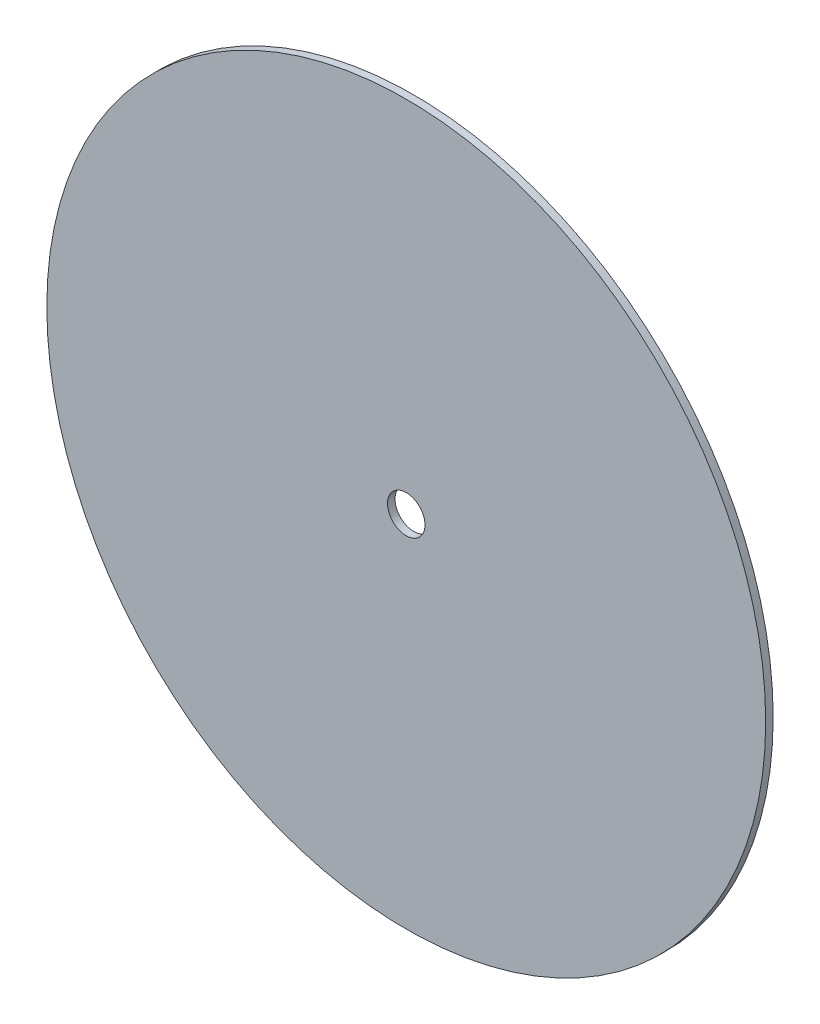
ISO-10303-21;
HEADER;
FILE_DESCRIPTION(('STEP AP214'),'2;1');
FILE_NAME('part.step','',(''),(''),'','','');
FILE_SCHEMA(('AUTOMOTIVE_DESIGN { 1 0 10303 214 1 1 1 1 }'));
ENDSEC;
DATA;
#1=APPLICATION_CONTEXT('core data for automotive mechanical design processes');
#2=APPLICATION_PROTOCOL_DEFINITION('international standard','automotive_design',2000,#1);
#3=PRODUCT_CONTEXT('',#1,'mechanical');
#4=PRODUCT('Part','Part','',(#3));
#5=PRODUCT_RELATED_PRODUCT_CATEGORY('part','',(#4));
#6=PRODUCT_DEFINITION_FORMATION('','',#4);
#7=PRODUCT_DEFINITION_CONTEXT('part definition',#1,'design');
#8=PRODUCT_DEFINITION('design','',#6,#7);
#9=PRODUCT_DEFINITION_SHAPE('','',#8);
#10=(LENGTH_UNIT() NAMED_UNIT(*) SI_UNIT(.MILLI.,.METRE.));
#11=(NAMED_UNIT(*) PLANE_ANGLE_UNIT() SI_UNIT($,.RADIAN.));
#12=(NAMED_UNIT(*) SI_UNIT($,.STERADIAN.) SOLID_ANGLE_UNIT());
#13=UNCERTAINTY_MEASURE_WITH_UNIT(LENGTH_MEASURE(1.E-05),#10,'distance_accuracy_value','');
#14=(GEOMETRIC_REPRESENTATION_CONTEXT(3) GLOBAL_UNCERTAINTY_ASSIGNED_CONTEXT((#13)) GLOBAL_UNIT_ASSIGNED_CONTEXT((#10,
#11,#12)) REPRESENTATION_CONTEXT('',''));
#15=CARTESIAN_POINT('',(0.,0.,0.));
#16=DIRECTION('',(0.,0.,1.));
#17=DIRECTION('',(1.,0.,0.));
#18=AXIS2_PLACEMENT_3D('',#15,#16,#17);
#19=CARTESIAN_POINT('',(0.,0.,1.5875));
#20=DIRECTION('',(0.,0.,1.));
#21=DIRECTION('',(1.,0.,0.));
#22=AXIS2_PLACEMENT_3D('',#19,#20,#21);
#23=PLANE('',#22);
#24=CARTESIAN_POINT('',(0.,0.,1.5875));
#25=DIRECTION('',(0.,0.,1.));
#26=DIRECTION('',(1.,0.,0.));
#27=AXIS2_PLACEMENT_3D('',#24,#25,#26);
#28=CIRCLE('',#27,152.4);
#29=CARTESIAN_POINT('',(152.4,0.,1.5875));
#30=VERTEX_POINT('',#29);
#31=EDGE_CURVE('E10',#30,#30,#28,.T.);
#32=ORIENTED_EDGE('',*,*,#31,.T.);
#33=EDGE_LOOP('',(#32));
#34=FACE_BOUND('',#33,.T.);
#35=CARTESIAN_POINT('',(0.,0.,1.5875));
#36=DIRECTION('',(0.,0.,1.));
#37=DIRECTION('',(1.,0.,0.));
#38=AXIS2_PLACEMENT_3D('',#35,#36,#37);
#39=CIRCLE('',#38,7.9375);
#40=CARTESIAN_POINT('',(7.9375,0.,1.5875));
#41=VERTEX_POINT('',#40);
#42=EDGE_CURVE('E48',#41,#41,#39,.T.);
#43=ORIENTED_EDGE('',*,*,#42,.F.);
#44=EDGE_LOOP('',(#43));
#45=FACE_BOUND('',#44,.T.);
#46=ADVANCED_FACE('F37',(#34,#45),#23,.T.);
#47=CARTESIAN_POINT('',(0.,0.,-1.5875));
#48=DIRECTION('',(0.,0.,1.));
#49=DIRECTION('',(1.,0.,0.));
#50=AXIS2_PLACEMENT_3D('',#47,#48,#49);
#51=PLANE('',#50);
#52=CARTESIAN_POINT('',(0.,0.,-1.5875));
#53=DIRECTION('',(0.,0.,1.));
#54=DIRECTION('',(1.,0.,0.));
#55=AXIS2_PLACEMENT_3D('',#52,#53,#54);
#56=CIRCLE('',#55,152.4);
#57=CARTESIAN_POINT('',(152.4,0.,-1.5875));
#58=VERTEX_POINT('',#57);
#59=EDGE_CURVE('E41',#58,#58,#56,.T.);
#60=ORIENTED_EDGE('',*,*,#59,.F.);
#61=EDGE_LOOP('',(#60));
#62=FACE_BOUND('',#61,.T.);
#63=CARTESIAN_POINT('',(0.,0.,-1.5875));
#64=DIRECTION('',(0.,0.,1.));
#65=DIRECTION('',(1.,0.,0.));
#66=AXIS2_PLACEMENT_3D('',#63,#64,#65);
#67=CIRCLE('',#66,7.9375);
#68=CARTESIAN_POINT('',(7.9375,0.,-1.5875));
#69=VERTEX_POINT('',#68);
#70=EDGE_CURVE('E50',#69,#69,#67,.T.);
#71=ORIENTED_EDGE('',*,*,#70,.T.);
#72=EDGE_LOOP('',(#71));
#73=FACE_BOUND('',#72,.T.);
#74=ADVANCED_FACE('F60',(#62,#73),#51,.F.);
#75=CARTESIAN_POINT('',(0.,0.,1.5875));
#76=DIRECTION('',(0.,0.,-1.));
#77=DIRECTION('',(-1.,0.,0.));
#78=AXIS2_PLACEMENT_3D('',#75,#76,#77);
#79=CYLINDRICAL_SURFACE('',#78,152.4);
#80=ORIENTED_EDGE('',*,*,#31,.F.);
#81=EDGE_LOOP('',(#80));
#82=FACE_BOUND('',#81,.T.);
#83=ORIENTED_EDGE('',*,*,#59,.T.);
#84=EDGE_LOOP('',(#83));
#85=FACE_BOUND('',#84,.T.);
#86=ADVANCED_FACE('F39',(#82,#85),#79,.T.);
#87=CARTESIAN_POINT('',(0.,0.,1.5875));
#88=DIRECTION('',(0.,0.,-1.));
#89=DIRECTION('',(-1.,0.,0.));
#90=AXIS2_PLACEMENT_3D('',#87,#88,#89);
#91=CYLINDRICAL_SURFACE('',#90,7.9375);
#92=ORIENTED_EDGE('',*,*,#42,.T.);
#93=EDGE_LOOP('',(#92));
#94=FACE_BOUND('',#93,.T.);
#95=ORIENTED_EDGE('',*,*,#70,.F.);
#96=EDGE_LOOP('',(#95));
#97=FACE_BOUND('',#96,.T.);
#98=ADVANCED_FACE('F56',(#94,#97),#91,.F.);
#99=CLOSED_SHELL('',(#46,#74,#86,#98));
#100=MANIFOLD_SOLID_BREP('B2',#99);
#101=ADVANCED_BREP_SHAPE_REPRESENTATION('',(#18,#100),#14);
#102=SHAPE_DEFINITION_REPRESENTATION(#9,#101);
ENDSEC;
END-ISO-10303-21;
